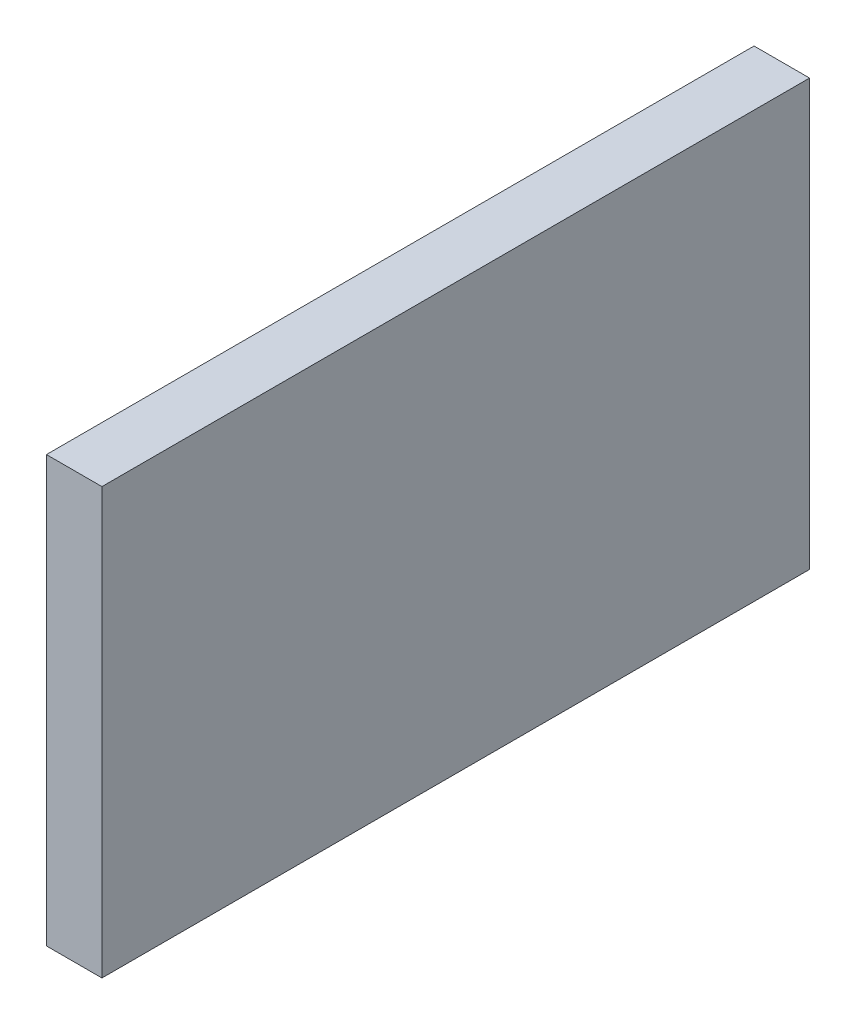
ISO-10303-21;
HEADER;
FILE_DESCRIPTION(('STEP AP214'),'2;1');
FILE_NAME('part.step','',(''),(''),'','','');
FILE_SCHEMA(('AUTOMOTIVE_DESIGN { 1 0 10303 214 1 1 1 1 }'));
ENDSEC;
DATA;
#1=APPLICATION_CONTEXT('core data for automotive mechanical design processes');
#2=APPLICATION_PROTOCOL_DEFINITION('international standard','automotive_design',2000,#1);
#3=PRODUCT_CONTEXT('',#1,'mechanical');
#4=PRODUCT('Part','Part','',(#3));
#5=PRODUCT_RELATED_PRODUCT_CATEGORY('part','',(#4));
#6=PRODUCT_DEFINITION_FORMATION('','',#4);
#7=PRODUCT_DEFINITION_CONTEXT('part definition',#1,'design');
#8=PRODUCT_DEFINITION('design','',#6,#7);
#9=PRODUCT_DEFINITION_SHAPE('','',#8);
#10=(LENGTH_UNIT() NAMED_UNIT(*) SI_UNIT(.MILLI.,.METRE.));
#11=(NAMED_UNIT(*) PLANE_ANGLE_UNIT() SI_UNIT($,.RADIAN.));
#12=(NAMED_UNIT(*) SI_UNIT($,.STERADIAN.) SOLID_ANGLE_UNIT());
#13=UNCERTAINTY_MEASURE_WITH_UNIT(LENGTH_MEASURE(1.E-05),#10,'distance_accuracy_value','');
#14=(GEOMETRIC_REPRESENTATION_CONTEXT(3) GLOBAL_UNCERTAINTY_ASSIGNED_CONTEXT((#13)) GLOBAL_UNIT_ASSIGNED_CONTEXT((#10,
#11,#12)) REPRESENTATION_CONTEXT('',''));
#15=CARTESIAN_POINT('',(0.,0.,0.));
#16=DIRECTION('',(0.,0.,1.));
#17=DIRECTION('',(1.,0.,0.));
#18=AXIS2_PLACEMENT_3D('',#15,#16,#17);
#19=CARTESIAN_POINT('',(56.3577322147439,44.8268255638794,14.5821985175526));
#20=DIRECTION('',(-1.,0.,0.));
#21=DIRECTION('',(0.,0.,1.));
#22=AXIS2_PLACEMENT_3D('',#19,#20,#21);
#23=PLANE('',#22);
#24=DIRECTION('',(0.,-1.,0.));
#25=VECTOR('',#24,1.);
#26=CARTESIAN_POINT('',(56.3577322147439,44.8268255638794,37.7805319551957));
#27=LINE('',#26,#25);
#28=CARTESIAN_POINT('',(56.3577322147439,44.8268255638794,37.7805319551957));
#29=VERTEX_POINT('',#28);
#30=CARTESIAN_POINT('',(56.3577322147439,21.8232894382297,37.7805319551957));
#31=VERTEX_POINT('',#30);
#32=EDGE_CURVE('E82',#29,#31,#27,.T.);
#33=ORIENTED_EDGE('',*,*,#32,.F.);
#34=DIRECTION('',(0.,0.,1.));
#35=VECTOR('',#34,1.);
#36=CARTESIAN_POINT('',(56.3577322147439,44.8268255638794,14.5821985175526));
#37=LINE('',#36,#35);
#38=CARTESIAN_POINT('',(56.3577322147439,44.8268255638794,76.0305319551957));
#39=VERTEX_POINT('',#38);
#40=EDGE_CURVE('E36',#29,#39,#37,.T.);
#41=ORIENTED_EDGE('',*,*,#40,.T.);
#42=DIRECTION('',(0.,-1.,0.));
#43=VECTOR('',#42,1.);
#44=CARTESIAN_POINT('',(56.3577322147439,44.8268255638794,76.0305319551957));
#45=LINE('',#44,#43);
#46=CARTESIAN_POINT('',(56.3577322147439,21.8232894382297,76.0305319551957));
#47=VERTEX_POINT('',#46);
#48=EDGE_CURVE('E80',#39,#47,#45,.T.);
#49=ORIENTED_EDGE('',*,*,#48,.T.);
#50=DIRECTION('',(0.,0.,1.));
#51=VECTOR('',#50,1.);
#52=CARTESIAN_POINT('',(56.3577322147439,21.8232894382297,14.5821985175526));
#53=LINE('',#52,#51);
#54=EDGE_CURVE('E71',#31,#47,#53,.T.);
#55=ORIENTED_EDGE('',*,*,#54,.F.);
#56=EDGE_LOOP('',(#33,#41,#49,#55));
#57=FACE_BOUND('',#56,.T.);
#58=ADVANCED_FACE('F32',(#57),#23,.F.);
#59=CARTESIAN_POINT('',(56.3577322147439,21.8232894382297,14.5821985175526));
#60=DIRECTION('',(0.,1.,0.));
#61=DIRECTION('',(0.,0.,1.));
#62=AXIS2_PLACEMENT_3D('',#59,#60,#61);
#63=PLANE('',#62);
#64=DIRECTION('',(-1.,0.,0.));
#65=VECTOR('',#64,1.);
#66=CARTESIAN_POINT('',(56.3577322147439,21.8232894382297,37.7805319551957));
#67=LINE('',#66,#65);
#68=CARTESIAN_POINT('',(53.3577322147439,21.8232894382297,37.7805319551957));
#69=VERTEX_POINT('',#68);
#70=EDGE_CURVE('E41',#31,#69,#67,.T.);
#71=ORIENTED_EDGE('',*,*,#70,.F.);
#72=ORIENTED_EDGE('',*,*,#54,.T.);
#73=DIRECTION('',(-1.,0.,0.));
#74=VECTOR('',#73,1.);
#75=CARTESIAN_POINT('',(56.3577322147439,21.8232894382297,76.0305319551957));
#76=LINE('',#75,#74);
#77=CARTESIAN_POINT('',(53.3577322147439,21.8232894382297,76.0305319551957));
#78=VERTEX_POINT('',#77);
#79=EDGE_CURVE('E92',#47,#78,#76,.T.);
#80=ORIENTED_EDGE('',*,*,#79,.T.);
#81=DIRECTION('',(0.,0.,1.));
#82=VECTOR('',#81,1.);
#83=CARTESIAN_POINT('',(53.3577322147439,21.8232894382297,14.5821985175526));
#84=LINE('',#83,#82);
#85=EDGE_CURVE('E101',#69,#78,#84,.T.);
#86=ORIENTED_EDGE('',*,*,#85,.F.);
#87=EDGE_LOOP('',(#71,#72,#80,#86));
#88=FACE_BOUND('',#87,.T.);
#89=ADVANCED_FACE('F105',(#88),#63,.F.);
#90=CARTESIAN_POINT('',(53.3577322147439,44.8268255638794,14.5821985175526));
#91=DIRECTION('',(1.,0.,0.));
#92=DIRECTION('',(0.,0.,-1.));
#93=AXIS2_PLACEMENT_3D('',#90,#91,#92);
#94=PLANE('',#93);
#95=DIRECTION('',(0.,1.,0.));
#96=VECTOR('',#95,1.);
#97=CARTESIAN_POINT('',(53.3577322147439,44.8268255638794,37.7805319551957));
#98=LINE('',#97,#96);
#99=CARTESIAN_POINT('',(53.3577322147439,44.8268255638794,37.7805319551957));
#100=VERTEX_POINT('',#99);
#101=EDGE_CURVE('E11',#69,#100,#98,.T.);
#102=ORIENTED_EDGE('',*,*,#101,.F.);
#103=ORIENTED_EDGE('',*,*,#85,.T.);
#104=DIRECTION('',(0.,1.,0.));
#105=VECTOR('',#104,1.);
#106=CARTESIAN_POINT('',(53.3577322147439,44.8268255638794,76.0305319551957));
#107=LINE('',#106,#105);
#108=CARTESIAN_POINT('',(53.3577322147439,44.8268255638794,76.0305319551957));
#109=VERTEX_POINT('',#108);
#110=EDGE_CURVE('E102',#78,#109,#107,.T.);
#111=ORIENTED_EDGE('',*,*,#110,.T.);
#112=DIRECTION('',(0.,0.,1.));
#113=VECTOR('',#112,1.);
#114=CARTESIAN_POINT('',(53.3577322147439,44.8268255638794,14.5821985175526));
#115=LINE('',#114,#113);
#116=EDGE_CURVE('E54',#100,#109,#115,.T.);
#117=ORIENTED_EDGE('',*,*,#116,.F.);
#118=EDGE_LOOP('',(#102,#103,#111,#117));
#119=FACE_BOUND('',#118,.T.);
#120=ADVANCED_FACE('F104',(#119),#94,.F.);
#121=CARTESIAN_POINT('',(56.3577322147439,44.8268255638794,14.5821985175526));
#122=DIRECTION('',(0.,-1.,0.));
#123=DIRECTION('',(0.,0.,-1.));
#124=AXIS2_PLACEMENT_3D('',#121,#122,#123);
#125=PLANE('',#124);
#126=DIRECTION('',(1.,0.,0.));
#127=VECTOR('',#126,1.);
#128=CARTESIAN_POINT('',(56.3577322147439,44.8268255638794,37.7805319551957));
#129=LINE('',#128,#127);
#130=EDGE_CURVE('E89',#100,#29,#129,.T.);
#131=ORIENTED_EDGE('',*,*,#130,.F.);
#132=ORIENTED_EDGE('',*,*,#116,.T.);
#133=DIRECTION('',(1.,0.,0.));
#134=VECTOR('',#133,1.);
#135=CARTESIAN_POINT('',(56.3577322147439,44.8268255638794,76.0305319551957));
#136=LINE('',#135,#134);
#137=EDGE_CURVE('E85',#109,#39,#136,.T.);
#138=ORIENTED_EDGE('',*,*,#137,.T.);
#139=ORIENTED_EDGE('',*,*,#40,.F.);
#140=EDGE_LOOP('',(#131,#132,#138,#139));
#141=FACE_BOUND('',#140,.T.);
#142=ADVANCED_FACE('F86',(#141),#125,.F.);
#143=CARTESIAN_POINT('',(0.,0.,76.0305319551957));
#144=DIRECTION('',(0.,0.,-1.));
#145=DIRECTION('',(-1.,0.,0.));
#146=AXIS2_PLACEMENT_3D('',#143,#144,#145);
#147=PLANE('',#146);
#148=ORIENTED_EDGE('',*,*,#48,.F.);
#149=ORIENTED_EDGE('',*,*,#137,.F.);
#150=ORIENTED_EDGE('',*,*,#110,.F.);
#151=ORIENTED_EDGE('',*,*,#79,.F.);
#152=EDGE_LOOP('',(#148,#149,#150,#151));
#153=FACE_BOUND('',#152,.T.);
#154=ADVANCED_FACE('F91',(#153),#147,.F.);
#155=CARTESIAN_POINT('',(31.752929169062,28.779527669284,37.7805319551957));
#156=DIRECTION('',(0.,0.,-1.));
#157=DIRECTION('',(-1.,0.,0.));
#158=AXIS2_PLACEMENT_3D('',#155,#156,#157);
#159=PLANE('',#158);
#160=ORIENTED_EDGE('',*,*,#130,.T.);
#161=ORIENTED_EDGE('',*,*,#32,.T.);
#162=ORIENTED_EDGE('',*,*,#70,.T.);
#163=ORIENTED_EDGE('',*,*,#101,.T.);
#164=EDGE_LOOP('',(#160,#161,#162,#163));
#165=FACE_BOUND('',#164,.T.);
#166=ADVANCED_FACE('F34',(#165),#159,.T.);
#167=CLOSED_SHELL('',(#58,#89,#120,#142,#154,#166));
#168=MANIFOLD_SOLID_BREP('B2',#167);
#169=ADVANCED_BREP_SHAPE_REPRESENTATION('',(#18,#168),#14);
#170=SHAPE_DEFINITION_REPRESENTATION(#9,#169);
ENDSEC;
END-ISO-10303-21;
